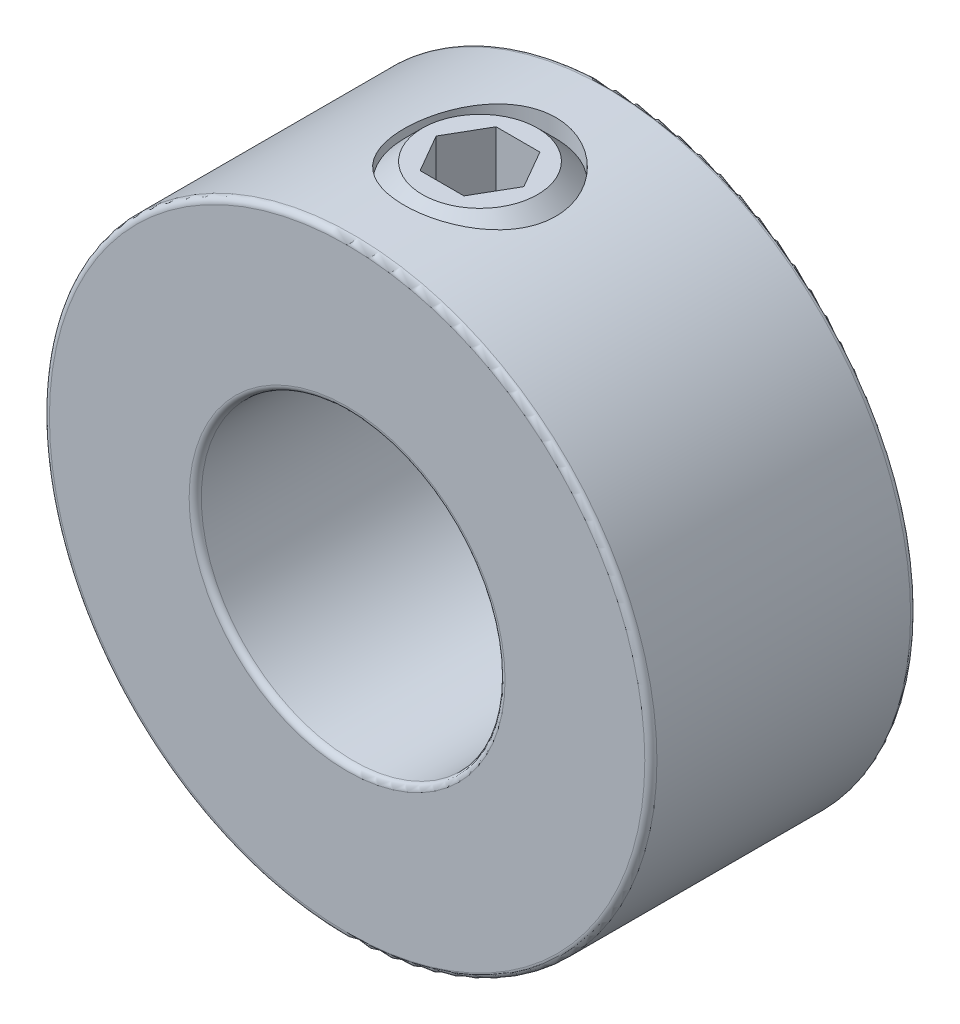
ISO-10303-21;
HEADER;
FILE_DESCRIPTION(('STEP AP214'),'2;1');
FILE_NAME('part.step','',(''),(''),'','','');
FILE_SCHEMA(('AUTOMOTIVE_DESIGN { 1 0 10303 214 1 1 1 1 }'));
ENDSEC;
DATA;
#1=APPLICATION_CONTEXT('core data for automotive mechanical design processes');
#2=APPLICATION_PROTOCOL_DEFINITION('international standard','automotive_design',2000,#1);
#3=PRODUCT_CONTEXT('',#1,'mechanical');
#4=PRODUCT('Part','Part','',(#3));
#5=PRODUCT_RELATED_PRODUCT_CATEGORY('part','',(#4));
#6=PRODUCT_DEFINITION_FORMATION('','',#4);
#7=PRODUCT_DEFINITION_CONTEXT('part definition',#1,'design');
#8=PRODUCT_DEFINITION('design','',#6,#7);
#9=PRODUCT_DEFINITION_SHAPE('','',#8);
#10=(LENGTH_UNIT() NAMED_UNIT(*) SI_UNIT(.MILLI.,.METRE.));
#11=(NAMED_UNIT(*) PLANE_ANGLE_UNIT() SI_UNIT($,.RADIAN.));
#12=(NAMED_UNIT(*) SI_UNIT($,.STERADIAN.) SOLID_ANGLE_UNIT());
#13=UNCERTAINTY_MEASURE_WITH_UNIT(LENGTH_MEASURE(1.E-05),#10,'distance_accuracy_value','');
#14=(GEOMETRIC_REPRESENTATION_CONTEXT(3) GLOBAL_UNCERTAINTY_ASSIGNED_CONTEXT((#13)) GLOBAL_UNIT_ASSIGNED_CONTEXT((#10,
#11,#12)) REPRESENTATION_CONTEXT('',''));
#15=CARTESIAN_POINT('',(0.,0.,0.));
#16=DIRECTION('',(0.,0.,1.));
#17=DIRECTION('',(1.,0.,0.));
#18=AXIS2_PLACEMENT_3D('',#15,#16,#17);
#19=CARTESIAN_POINT('',(0.,12.7,0.));
#20=DIRECTION('',(0.,1.,0.));
#21=DIRECTION('',(-1.,0.,0.));
#22=AXIS2_PLACEMENT_3D('',#19,#20,#21);
#23=PLANE('',#22);
#24=CARTESIAN_POINT('',(0.,12.7,0.));
#25=DIRECTION('',(0.,1.,0.));
#26=DIRECTION('',(-1.,0.,0.));
#27=AXIS2_PLACEMENT_3D('',#24,#25,#26);
#28=CIRCLE('',#27,2.40819263124403);
#29=CARTESIAN_POINT('',(-2.40819263124403,12.7,0.));
#30=VERTEX_POINT('',#29);
#31=EDGE_CURVE('E12',#30,#30,#28,.T.);
#32=ORIENTED_EDGE('',*,*,#31,.T.);
#33=EDGE_LOOP('',(#32));
#34=FACE_BOUND('',#33,.T.);
#35=DIRECTION('',(1.,0.,0.));
#36=VECTOR('',#35,1.);
#37=CARTESIAN_POINT('',(-0.916543552338532,12.7,-1.5875));
#38=LINE('',#37,#36);
#39=CARTESIAN_POINT('',(-0.916543552338532,12.7,-1.5875));
#40=VERTEX_POINT('',#39);
#41=CARTESIAN_POINT('',(0.916543552338531,12.7,-1.5875));
#42=VERTEX_POINT('',#41);
#43=EDGE_CURVE('E110',#40,#42,#38,.T.);
#44=ORIENTED_EDGE('',*,*,#43,.T.);
#45=DIRECTION('',(0.5,0.,0.866025403784439));
#46=VECTOR('',#45,1.);
#47=CARTESIAN_POINT('',(0.916543552338531,12.7,-1.5875));
#48=LINE('',#47,#46);
#49=CARTESIAN_POINT('',(1.83308710467706,12.7,0.));
#50=VERTEX_POINT('',#49);
#51=EDGE_CURVE('E56',#42,#50,#48,.T.);
#52=ORIENTED_EDGE('',*,*,#51,.T.);
#53=DIRECTION('',(-0.5,0.,0.866025403784439));
#54=VECTOR('',#53,1.);
#55=CARTESIAN_POINT('',(1.83308710467706,12.7,0.));
#56=LINE('',#55,#54);
#57=CARTESIAN_POINT('',(0.916543552338533,12.7,1.5875));
#58=VERTEX_POINT('',#57);
#59=EDGE_CURVE('E114',#50,#58,#56,.T.);
#60=ORIENTED_EDGE('',*,*,#59,.T.);
#61=DIRECTION('',(-1.,0.,0.));
#62=VECTOR('',#61,1.);
#63=CARTESIAN_POINT('',(0.916543552338533,12.7,1.5875));
#64=LINE('',#63,#62);
#65=CARTESIAN_POINT('',(-0.916543552338531,12.7,1.5875));
#66=VERTEX_POINT('',#65);
#67=EDGE_CURVE('E177',#58,#66,#64,.T.);
#68=ORIENTED_EDGE('',*,*,#67,.T.);
#69=DIRECTION('',(-0.5,0.,-0.866025403784439));
#70=VECTOR('',#69,1.);
#71=CARTESIAN_POINT('',(-0.916543552338531,12.7,1.5875));
#72=LINE('',#71,#70);
#73=CARTESIAN_POINT('',(-1.83308710467706,12.7,0.));
#74=VERTEX_POINT('',#73);
#75=EDGE_CURVE('E162',#66,#74,#72,.T.);
#76=ORIENTED_EDGE('',*,*,#75,.T.);
#77=DIRECTION('',(0.5,0.,-0.866025403784439));
#78=VECTOR('',#77,1.);
#79=CARTESIAN_POINT('',(-1.83308710467706,12.7,0.));
#80=LINE('',#79,#78);
#81=EDGE_CURVE('E158',#74,#40,#80,.T.);
#82=ORIENTED_EDGE('',*,*,#81,.T.);
#83=EDGE_LOOP('',(#44,#52,#60,#68,#76,#82));
#84=FACE_BOUND('',#83,.T.);
#85=ADVANCED_FACE('F42',(#34,#84),#23,.T.);
#86=CARTESIAN_POINT('',(0.,12.7,0.));
#87=DIRECTION('',(0.,-1.,0.));
#88=DIRECTION('',(1.,0.,0.));
#89=AXIS2_PLACEMENT_3D('',#86,#87,#88);
#90=CONICAL_SURFACE('',#89,2.40819263124403,0.785398163397448);
#91=CARTESIAN_POINT('',(0.,11.933192631244,0.));
#92=DIRECTION('',(0.,1.,0.));
#93=DIRECTION('',(-1.,0.,0.));
#94=AXIS2_PLACEMENT_3D('',#91,#92,#93);
#95=CIRCLE('',#94,3.175);
#96=CARTESIAN_POINT('',(-3.175,11.933192631244,0.));
#97=VERTEX_POINT('',#96);
#98=EDGE_CURVE('E49',#97,#97,#95,.T.);
#99=ORIENTED_EDGE('',*,*,#98,.T.);
#100=EDGE_LOOP('',(#99));
#101=FACE_BOUND('',#100,.T.);
#102=ORIENTED_EDGE('',*,*,#31,.F.);
#103=EDGE_LOOP('',(#102));
#104=FACE_BOUND('',#103,.T.);
#105=ADVANCED_FACE('F132',(#101,#104),#90,.T.);
#106=CARTESIAN_POINT('',(0.,6.35,0.));
#107=DIRECTION('',(0.,1.,0.));
#108=DIRECTION('',(-1.,0.,0.));
#109=AXIS2_PLACEMENT_3D('',#106,#107,#108);
#110=CYLINDRICAL_SURFACE('',#109,3.175);
#111=CARTESIAN_POINT('',(0.,7.11680736875596,0.));
#112=DIRECTION('',(0.,1.,0.));
#113=DIRECTION('',(-1.,0.,0.));
#114=AXIS2_PLACEMENT_3D('',#111,#112,#113);
#115=CIRCLE('',#114,3.175);
#116=CARTESIAN_POINT('',(-3.175,7.11680736875596,0.));
#117=VERTEX_POINT('',#116);
#118=EDGE_CURVE('E127',#117,#117,#115,.T.);
#119=ORIENTED_EDGE('',*,*,#118,.T.);
#120=EDGE_LOOP('',(#119));
#121=FACE_BOUND('',#120,.T.);
#122=ORIENTED_EDGE('',*,*,#98,.F.);
#123=EDGE_LOOP('',(#122));
#124=FACE_BOUND('',#123,.T.);
#125=ADVANCED_FACE('F135',(#121,#124),#110,.T.);
#126=CARTESIAN_POINT('',(0.,7.11680736875596,0.));
#127=DIRECTION('',(0.,1.,0.));
#128=DIRECTION('',(-1.,0.,0.));
#129=AXIS2_PLACEMENT_3D('',#126,#127,#128);
#130=CONICAL_SURFACE('',#129,3.175,0.785398163397449);
#131=CARTESIAN_POINT('',(0.,6.35,0.));
#132=DIRECTION('',(0.,1.,0.));
#133=DIRECTION('',(-1.,0.,0.));
#134=AXIS2_PLACEMENT_3D('',#131,#132,#133);
#135=CIRCLE('',#134,2.40819263124403);
#136=CARTESIAN_POINT('',(-2.40819263124403,6.35,0.));
#137=VERTEX_POINT('',#136);
#138=EDGE_CURVE('E119',#137,#137,#135,.T.);
#139=ORIENTED_EDGE('',*,*,#138,.T.);
#140=EDGE_LOOP('',(#139));
#141=FACE_BOUND('',#140,.T.);
#142=ORIENTED_EDGE('',*,*,#118,.F.);
#143=EDGE_LOOP('',(#142));
#144=FACE_BOUND('',#143,.T.);
#145=ADVANCED_FACE('F137',(#141,#144),#130,.T.);
#146=CARTESIAN_POINT('',(-2.40819263124403,6.35,0.));
#147=DIRECTION('',(0.,-1.,0.));
#148=DIRECTION('',(1.,0.,0.));
#149=AXIS2_PLACEMENT_3D('',#146,#147,#148);
#150=PLANE('',#149);
#151=CARTESIAN_POINT('',(0.,6.35,0.));
#152=DIRECTION('',(0.,1.,0.));
#153=DIRECTION('',(-1.,0.,0.));
#154=AXIS2_PLACEMENT_3D('',#151,#152,#153);
#155=CIRCLE('',#154,0.920168842507158);
#156=CARTESIAN_POINT('',(-0.920168842507158,6.35,0.));
#157=VERTEX_POINT('',#156);
#158=EDGE_CURVE('E115',#157,#157,#155,.T.);
#159=ORIENTED_EDGE('',*,*,#158,.T.);
#160=EDGE_LOOP('',(#159));
#161=FACE_BOUND('',#160,.T.);
#162=ORIENTED_EDGE('',*,*,#138,.F.);
#163=EDGE_LOOP('',(#162));
#164=FACE_BOUND('',#163,.T.);
#165=ADVANCED_FACE('F144',(#161,#164),#150,.T.);
#166=CARTESIAN_POINT('',(0.,6.35,0.));
#167=DIRECTION('',(0.,-1.,0.));
#168=DIRECTION('',(1.,0.,0.));
#169=AXIS2_PLACEMENT_3D('',#166,#167,#168);
#170=CONICAL_SURFACE('',#169,0.920168842507158,0.785398163397448);
#171=CARTESIAN_POINT('',(0.,7.27016884250716,0.));
#172=VERTEX_POINT('',#171);
#173=VERTEX_LOOP('',#172);
#174=FACE_BOUND('',#173,.T.);
#175=ORIENTED_EDGE('',*,*,#158,.F.);
#176=EDGE_LOOP('',(#175));
#177=FACE_BOUND('',#176,.T.);
#178=ADVANCED_FACE('F211',(#174,#177),#170,.F.);
#179=CARTESIAN_POINT('',(0.916543552338531,9.52499999999999,-1.5875));
#180=DIRECTION('',(-0.866025403784439,0.,0.5));
#181=DIRECTION('',(0.5,0.,0.866025403784439));
#182=AXIS2_PLACEMENT_3D('',#179,#180,#181);
#183=PLANE('',#182);
#184=ORIENTED_EDGE('',*,*,#51,.F.);
#185=DIRECTION('',(0.,1.,0.));
#186=VECTOR('',#185,1.);
#187=CARTESIAN_POINT('',(0.916543552338531,9.52499999999999,-1.5875));
#188=LINE('',#187,#186);
#189=CARTESIAN_POINT('',(0.916543552338531,9.52499999999999,-1.5875));
#190=VERTEX_POINT('',#189);
#191=EDGE_CURVE('E109',#190,#42,#188,.T.);
#192=ORIENTED_EDGE('',*,*,#191,.F.);
#193=DIRECTION('',(0.5,0.,0.866025403784439));
#194=VECTOR('',#193,1.);
#195=CARTESIAN_POINT('',(0.916543552338531,9.52499999999999,-1.5875));
#196=LINE('',#195,#194);
#197=CARTESIAN_POINT('',(1.83308710467706,9.52499999999999,0.));
#198=VERTEX_POINT('',#197);
#199=EDGE_CURVE('E100',#190,#198,#196,.T.);
#200=ORIENTED_EDGE('',*,*,#199,.T.);
#201=DIRECTION('',(0.,1.,0.));
#202=VECTOR('',#201,1.);
#203=CARTESIAN_POINT('',(1.83308710467706,9.52499999999999,0.));
#204=LINE('',#203,#202);
#205=EDGE_CURVE('E108',#198,#50,#204,.T.);
#206=ORIENTED_EDGE('',*,*,#205,.T.);
#207=EDGE_LOOP('',(#184,#192,#200,#206));
#208=FACE_BOUND('',#207,.T.);
#209=ADVANCED_FACE('F107',(#208),#183,.T.);
#210=CARTESIAN_POINT('',(1.83308710467706,9.52499999999999,0.));
#211=DIRECTION('',(-0.866025403784439,0.,-0.5));
#212=DIRECTION('',(-0.5,0.,0.866025403784439));
#213=AXIS2_PLACEMENT_3D('',#210,#211,#212);
#214=PLANE('',#213);
#215=ORIENTED_EDGE('',*,*,#59,.F.);
#216=ORIENTED_EDGE('',*,*,#205,.F.);
#217=DIRECTION('',(-0.5,0.,0.866025403784439));
#218=VECTOR('',#217,1.);
#219=CARTESIAN_POINT('',(1.83308710467706,9.52499999999999,0.));
#220=LINE('',#219,#218);
#221=CARTESIAN_POINT('',(0.916543552338533,9.52499999999999,1.5875));
#222=VERTEX_POINT('',#221);
#223=EDGE_CURVE('E96',#198,#222,#220,.T.);
#224=ORIENTED_EDGE('',*,*,#223,.T.);
#225=DIRECTION('',(0.,1.,0.));
#226=VECTOR('',#225,1.);
#227=CARTESIAN_POINT('',(0.916543552338533,9.52499999999999,1.5875));
#228=LINE('',#227,#226);
#229=EDGE_CURVE('E116',#222,#58,#228,.T.);
#230=ORIENTED_EDGE('',*,*,#229,.T.);
#231=EDGE_LOOP('',(#215,#216,#224,#230));
#232=FACE_BOUND('',#231,.T.);
#233=ADVANCED_FACE('F112',(#232),#214,.T.);
#234=CARTESIAN_POINT('',(0.916543552338533,9.52499999999999,1.5875));
#235=DIRECTION('',(0.,0.,-1.));
#236=DIRECTION('',(-1.,0.,0.));
#237=AXIS2_PLACEMENT_3D('',#234,#235,#236);
#238=PLANE('',#237);
#239=ORIENTED_EDGE('',*,*,#67,.F.);
#240=ORIENTED_EDGE('',*,*,#229,.F.);
#241=DIRECTION('',(-1.,0.,0.));
#242=VECTOR('',#241,1.);
#243=CARTESIAN_POINT('',(0.916543552338533,9.52499999999999,1.5875));
#244=LINE('',#243,#242);
#245=CARTESIAN_POINT('',(-0.916543552338531,9.52499999999999,1.5875));
#246=VERTEX_POINT('',#245);
#247=EDGE_CURVE('E102',#222,#246,#244,.T.);
#248=ORIENTED_EDGE('',*,*,#247,.T.);
#249=DIRECTION('',(0.,1.,0.));
#250=VECTOR('',#249,1.);
#251=CARTESIAN_POINT('',(-0.916543552338531,9.52499999999999,1.5875));
#252=LINE('',#251,#250);
#253=EDGE_CURVE('E121',#246,#66,#252,.T.);
#254=ORIENTED_EDGE('',*,*,#253,.T.);
#255=EDGE_LOOP('',(#239,#240,#248,#254));
#256=FACE_BOUND('',#255,.T.);
#257=ADVANCED_FACE('F175',(#256),#238,.T.);
#258=CARTESIAN_POINT('',(-0.916543552338531,9.52499999999999,1.5875));
#259=DIRECTION('',(0.866025403784439,0.,-0.5));
#260=DIRECTION('',(-0.5,0.,-0.866025403784439));
#261=AXIS2_PLACEMENT_3D('',#258,#259,#260);
#262=PLANE('',#261);
#263=ORIENTED_EDGE('',*,*,#75,.F.);
#264=ORIENTED_EDGE('',*,*,#253,.F.);
#265=DIRECTION('',(-0.5,0.,-0.866025403784439));
#266=VECTOR('',#265,1.);
#267=CARTESIAN_POINT('',(-0.916543552338531,9.52499999999999,1.5875));
#268=LINE('',#267,#266);
#269=CARTESIAN_POINT('',(-1.83308710467706,9.52499999999999,0.));
#270=VERTEX_POINT('',#269);
#271=EDGE_CURVE('E188',#246,#270,#268,.T.);
#272=ORIENTED_EDGE('',*,*,#271,.T.);
#273=DIRECTION('',(0.,1.,0.));
#274=VECTOR('',#273,1.);
#275=CARTESIAN_POINT('',(-1.83308710467706,9.52499999999999,0.));
#276=LINE('',#275,#274);
#277=EDGE_CURVE('E170',#270,#74,#276,.T.);
#278=ORIENTED_EDGE('',*,*,#277,.T.);
#279=EDGE_LOOP('',(#263,#264,#272,#278));
#280=FACE_BOUND('',#279,.T.);
#281=ADVANCED_FACE('F179',(#280),#262,.T.);
#282=CARTESIAN_POINT('',(-1.83308710467706,9.52499999999999,0.));
#283=DIRECTION('',(0.866025403784439,0.,0.5));
#284=DIRECTION('',(0.5,0.,-0.866025403784439));
#285=AXIS2_PLACEMENT_3D('',#282,#283,#284);
#286=PLANE('',#285);
#287=ORIENTED_EDGE('',*,*,#81,.F.);
#288=ORIENTED_EDGE('',*,*,#277,.F.);
#289=DIRECTION('',(0.5,0.,-0.866025403784439));
#290=VECTOR('',#289,1.);
#291=CARTESIAN_POINT('',(-1.83308710467706,9.52499999999999,0.));
#292=LINE('',#291,#290);
#293=CARTESIAN_POINT('',(-0.916543552338532,9.52499999999999,-1.5875));
#294=VERTEX_POINT('',#293);
#295=EDGE_CURVE('E186',#270,#294,#292,.T.);
#296=ORIENTED_EDGE('',*,*,#295,.T.);
#297=DIRECTION('',(0.,1.,0.));
#298=VECTOR('',#297,1.);
#299=CARTESIAN_POINT('',(-0.916543552338532,9.52499999999999,-1.5875));
#300=LINE('',#299,#298);
#301=EDGE_CURVE('E167',#294,#40,#300,.T.);
#302=ORIENTED_EDGE('',*,*,#301,.T.);
#303=EDGE_LOOP('',(#287,#288,#296,#302));
#304=FACE_BOUND('',#303,.T.);
#305=ADVANCED_FACE('F192',(#304),#286,.T.);
#306=CARTESIAN_POINT('',(-0.916543552338532,9.52499999999999,-1.5875));
#307=DIRECTION('',(0.,0.,1.));
#308=DIRECTION('',(1.,0.,0.));
#309=AXIS2_PLACEMENT_3D('',#306,#307,#308);
#310=PLANE('',#309);
#311=ORIENTED_EDGE('',*,*,#43,.F.);
#312=ORIENTED_EDGE('',*,*,#301,.F.);
#313=DIRECTION('',(1.,0.,0.));
#314=VECTOR('',#313,1.);
#315=CARTESIAN_POINT('',(-0.916543552338532,9.52499999999999,-1.5875));
#316=LINE('',#315,#314);
#317=EDGE_CURVE('E168',#294,#190,#316,.T.);
#318=ORIENTED_EDGE('',*,*,#317,.T.);
#319=ORIENTED_EDGE('',*,*,#191,.T.);
#320=EDGE_LOOP('',(#311,#312,#318,#319));
#321=FACE_BOUND('',#320,.T.);
#322=ADVANCED_FACE('F193',(#321),#310,.T.);
#323=CARTESIAN_POINT('',(0.916543552338531,9.52499999999999,-1.5875));
#324=DIRECTION('',(0.,1.,0.));
#325=DIRECTION('',(0.,0.,1.));
#326=AXIS2_PLACEMENT_3D('',#323,#324,#325);
#327=PLANE('',#326);
#328=ORIENTED_EDGE('',*,*,#199,.F.);
#329=ORIENTED_EDGE('',*,*,#317,.F.);
#330=ORIENTED_EDGE('',*,*,#295,.F.);
#331=ORIENTED_EDGE('',*,*,#271,.F.);
#332=ORIENTED_EDGE('',*,*,#247,.F.);
#333=ORIENTED_EDGE('',*,*,#223,.F.);
#334=EDGE_LOOP('',(#328,#329,#330,#331,#332,#333));
#335=FACE_BOUND('',#334,.T.);
#336=ADVANCED_FACE('F98',(#335),#327,.T.);
#337=CLOSED_SHELL('',(#85,#105,#125,#145,#165,#178,#209,#233,#257,#281,#305,#322,#336));
#338=MANIFOLD_SOLID_BREP('B2',#337);
#339=CARTESIAN_POINT('',(0.,0.,5.55625));
#340=DIRECTION('',(0.,0.,1.));
#341=DIRECTION('',(1.,0.,0.));
#342=AXIS2_PLACEMENT_3D('',#339,#340,#341);
#343=PLANE('',#342);
#344=CARTESIAN_POINT('',(0.,0.,5.55625));
#345=DIRECTION('',(0.,0.,1.));
#346=DIRECTION('',(1.,0.,0.));
#347=AXIS2_PLACEMENT_3D('',#344,#345,#346);
#348=CIRCLE('',#347,6.604);
#349=CARTESIAN_POINT('',(6.604,0.,5.55625));
#350=VERTEX_POINT('',#349);
#351=EDGE_CURVE('E336',#350,#350,#348,.F.);
#352=ORIENTED_EDGE('',*,*,#351,.T.);
#353=EDGE_LOOP('',(#352));
#354=FACE_BOUND('',#353,.T.);
#355=CARTESIAN_POINT('',(0.,0.,5.55625));
#356=DIRECTION('',(0.,0.,1.));
#357=DIRECTION('',(1.,0.,0.));
#358=AXIS2_PLACEMENT_3D('',#355,#356,#357);
#359=CIRCLE('',#358,12.446);
#360=CARTESIAN_POINT('',(12.446,0.,5.55625));
#361=VERTEX_POINT('',#360);
#362=EDGE_CURVE('E340',#361,#361,#359,.T.);
#363=ORIENTED_EDGE('',*,*,#362,.T.);
#364=EDGE_LOOP('',(#363));
#365=FACE_BOUND('',#364,.T.);
#366=ADVANCED_FACE('F325',(#354,#365),#343,.T.);
#367=CARTESIAN_POINT('',(0.,0.,-5.55625));
#368=DIRECTION('',(0.,0.,1.));
#369=DIRECTION('',(1.,0.,0.));
#370=AXIS2_PLACEMENT_3D('',#367,#368,#369);
#371=PLANE('',#370);
#372=CARTESIAN_POINT('',(0.,0.,-5.55625));
#373=DIRECTION('',(0.,0.,1.));
#374=DIRECTION('',(1.,0.,0.));
#375=AXIS2_PLACEMENT_3D('',#372,#373,#374);
#376=CIRCLE('',#375,6.604);
#377=CARTESIAN_POINT('',(6.604,0.,-5.55625));
#378=VERTEX_POINT('',#377);
#379=EDGE_CURVE('E351',#378,#378,#376,.T.);
#380=ORIENTED_EDGE('',*,*,#379,.T.);
#381=EDGE_LOOP('',(#380));
#382=FACE_BOUND('',#381,.T.);
#383=CARTESIAN_POINT('',(0.,0.,-5.55625));
#384=DIRECTION('',(0.,0.,1.));
#385=DIRECTION('',(1.,0.,0.));
#386=AXIS2_PLACEMENT_3D('',#383,#384,#385);
#387=CIRCLE('',#386,12.446);
#388=CARTESIAN_POINT('',(12.446,0.,-5.55625));
#389=VERTEX_POINT('',#388);
#390=EDGE_CURVE('E354',#389,#389,#387,.F.);
#391=ORIENTED_EDGE('',*,*,#390,.T.);
#392=EDGE_LOOP('',(#391));
#393=FACE_BOUND('',#392,.T.);
#394=ADVANCED_FACE('F388',(#382,#393),#371,.F.);
#395=CARTESIAN_POINT('',(0.,0.,5.55625));
#396=DIRECTION('',(0.,0.,-1.));
#397=DIRECTION('',(-1.,0.,0.));
#398=AXIS2_PLACEMENT_3D('',#395,#396,#397);
#399=CYLINDRICAL_SURFACE('',#398,12.7);
#400=CARTESIAN_POINT('',(0.,0.,-5.30225));
#401=DIRECTION('',(0.,0.,1.));
#402=DIRECTION('',(1.,0.,0.));
#403=AXIS2_PLACEMENT_3D('',#400,#401,#402);
#404=CIRCLE('',#403,12.7);
#405=CARTESIAN_POINT('',(12.7,0.,-5.30225));
#406=VERTEX_POINT('',#405);
#407=EDGE_CURVE('E41',#406,#406,#404,.T.);
#408=ORIENTED_EDGE('',*,*,#407,.T.);
#409=EDGE_LOOP('',(#408));
#410=FACE_BOUND('',#409,.T.);
#411=CARTESIAN_POINT('',(0.,0.,5.30225));
#412=DIRECTION('',(0.,0.,1.));
#413=DIRECTION('',(1.,0.,0.));
#414=AXIS2_PLACEMENT_3D('',#411,#412,#413);
#415=CIRCLE('',#414,12.7);
#416=CARTESIAN_POINT('',(12.7,0.,5.30225));
#417=VERTEX_POINT('',#416);
#418=EDGE_CURVE('E332',#417,#417,#415,.F.);
#419=ORIENTED_EDGE('',*,*,#418,.T.);
#420=EDGE_LOOP('',(#419));
#421=FACE_BOUND('',#420,.T.);
#422=CARTESIAN_POINT('',(0.,12.7,-3.175));
#423=CARTESIAN_POINT('',(0.175421054350931,12.6999970338729,-3.17499507718756));
#424=CARTESIAN_POINT('',(0.350897100741782,12.6963292371237,-3.16041288419548));
#425=CARTESIAN_POINT('',(0.69682005198096,12.6820530760661,-3.10255676306683));
#426=CARTESIAN_POINT('',(0.867264049209731,12.6714407780562,-3.05926657314488));
#427=CARTESIAN_POINT('',(1.19807751278645,12.6444507573613,-2.94547024683858));
#428=CARTESIAN_POINT('',(1.35845880926017,12.6280799601569,-2.87499679271934));
#429=CARTESIAN_POINT('',(1.6651226791977,12.591316443928,-2.70894939107175));
#430=CARTESIAN_POINT('',(1.81140477687155,12.5709235892463,-2.61337459688152));
#431=CARTESIAN_POINT('',(2.08873074612027,12.5278602543575,-2.39775832856532));
#432=CARTESIAN_POINT('',(2.2194428772959,12.5051546346353,-2.27729716633665));
#433=CARTESIAN_POINT('',(2.45903522924702,12.4602582924963,-2.01622616627587));
#434=CARTESIAN_POINT('',(2.56791298487579,12.4380676284689,-1.87561405642898));
#435=CARTESIAN_POINT('',(2.76230618225783,12.3963594189446,-1.57565677007337));
#436=CARTESIAN_POINT('',(2.84745052370821,12.3768864828385,-1.41606432812152));
#437=CARTESIAN_POINT('',(2.98957345643241,12.343330973648,-1.08426586198626));
#438=CARTESIAN_POINT('',(3.04655655068163,12.3292475388652,-0.912061859447231));
#439=CARTESIAN_POINT('',(3.12960773790342,12.3084267567388,-0.563576262139818));
#440=CARTESIAN_POINT('',(3.15627230130284,12.3015478927701,-0.387445470052915));
#441=CARTESIAN_POINT('',(3.17978742389056,12.2954915053947,-0.0330865289513835));
#442=CARTESIAN_POINT('',(3.176642833515,12.2963127290578,0.145141274131692));
#443=CARTESIAN_POINT('',(3.14110481048737,12.3054365167726,0.494063459727666));
#444=CARTESIAN_POINT('',(3.10942215340351,12.3135572669877,0.664835732101618));
#445=CARTESIAN_POINT('',(3.01884119561133,12.3360753547043,0.998560891095076));
#446=CARTESIAN_POINT('',(2.95994095604688,12.3504731393489,1.16151321974455));
#447=CARTESIAN_POINT('',(2.81599106163371,12.3840899110031,1.47687880106701));
#448=CARTESIAN_POINT('',(2.73068344564301,12.4033560981111,1.62916906362126));
#449=CARTESIAN_POINT('',(2.53652078423164,12.4445122129068,1.91752793565194));
#450=CARTESIAN_POINT('',(2.42766161831204,12.4664025994163,2.05359370007568));
#451=CARTESIAN_POINT('',(2.18580424890858,12.5111061380944,2.30971431988649));
#452=CARTESIAN_POINT('',(2.05220624645107,12.533927803951,2.42920200396319));
#453=CARTESIAN_POINT('',(1.76659522538283,12.5773596047503,2.64418496321526));
#454=CARTESIAN_POINT('',(1.61458164448181,12.5979696721291,2.73967950552455));
#455=CARTESIAN_POINT('',(1.29564529770895,12.6347586626604,2.90417374084162));
#456=CARTESIAN_POINT('',(1.12867311562492,12.6509221227036,2.97308130353854));
#457=CARTESIAN_POINT('',(0.785020883902435,12.676884242985,3.0816916304186));
#458=CARTESIAN_POINT('',(0.608342698201859,12.6866841206814,3.12139998108506));
#459=CARTESIAN_POINT('',(0.255142937325556,12.6986347345774,3.16961851376621));
#460=CARTESIAN_POINT('',(0.078733057308377,12.7009747992585,3.17890107185939));
#461=CARTESIAN_POINT('',(-0.273119584996527,12.6982813685726,3.16812294564922));
#462=CARTESIAN_POINT('',(-0.448562432914396,12.6932485369526,3.14806490274183));
#463=CARTESIAN_POINT('',(-0.790816868910238,12.6764961338622,3.07981157723825));
#464=CARTESIAN_POINT('',(-0.957717835150521,12.6648767569325,3.03203765897374));
#465=CARTESIAN_POINT('',(-1.28112793569116,12.6362609570897,2.91019000547309));
#466=CARTESIAN_POINT('',(-1.43763601861911,12.6192639911647,2.83611361420368));
#467=CARTESIAN_POINT('',(-1.73889063454314,12.5813250177716,2.6622668605486));
#468=CARTESIAN_POINT('',(-1.88337918521903,12.5603183592593,2.56206389542727));
#469=CARTESIAN_POINT('',(-2.15376466554501,12.5167921111412,2.33936135971267));
#470=CARTESIAN_POINT('',(-2.27965837982672,12.4942722608556,2.21685794114268));
#471=CARTESIAN_POINT('',(-2.51246336908675,12.4495762556412,1.94944584954746));
#472=CARTESIAN_POINT('',(-2.6188328531313,12.4274221051899,1.80406102865082));
#473=CARTESIAN_POINT('',(-2.80566443991221,12.3865825924258,1.49704925704163));
#474=CARTESIAN_POINT('',(-2.88612769264178,12.3678970761538,1.335423027713));
#475=CARTESIAN_POINT('',(-3.0182638402854,12.3363163381503,1.00138288757303));
#476=CARTESIAN_POINT('',(-3.07010730622843,12.3233869021911,0.829039853404032));
#477=CARTESIAN_POINT('',(-3.14398164687971,12.3047494152553,0.477711266541238));
#478=CARTESIAN_POINT('',(-3.16601904149253,12.299039785006,0.298727175343936));
#479=CARTESIAN_POINT('',(-3.17931501621074,12.2956087422145,-0.0552895005203962));
#480=CARTESIAN_POINT('',(-3.17143955029538,12.2976625750886,-0.230287904387485));
#481=CARTESIAN_POINT('',(-3.1271152390873,12.3090074061494,-0.576376564376255));
#482=CARTESIAN_POINT('',(-3.09066696801937,12.3182982588945,-0.747466898966899));
#483=CARTESIAN_POINT('',(-2.9907046261569,12.3429450180984,-1.07994123834368));
#484=CARTESIAN_POINT('',(-2.92735297324093,12.3582644892528,-1.24137696275537));
#485=CARTESIAN_POINT('',(-2.7755107337966,12.3932474960913,-1.5514433934137));
#486=CARTESIAN_POINT('',(-2.68701666057215,12.4129116342002,-1.70007231991313));
#487=CARTESIAN_POINT('',(-2.48468673461549,12.4550092586011,-1.98449063138675));
#488=CARTESIAN_POINT('',(-2.37025002816433,12.4775016056118,-2.11984393874715));
#489=CARTESIAN_POINT('',(-2.12045416901821,12.5223699100401,-2.36970791148384));
#490=CARTESIAN_POINT('',(-1.98509005500274,12.5447458385544,-2.48421362040584));
#491=CARTESIAN_POINT('',(-1.6943230585205,12.5873437112106,-2.69115393646168));
#492=CARTESIAN_POINT('',(-1.53860166056969,12.6075193062447,-2.78315126560482));
#493=CARTESIAN_POINT('',(-1.21341315929717,12.6429542453062,-2.93951546322414));
#494=CARTESIAN_POINT('',(-1.04395600927443,12.6582171100619,-3.0039021300394));
#495=CARTESIAN_POINT('',(-0.729001702698682,12.6798505941374,-3.09366037419776));
#496=CARTESIAN_POINT('',(-0.585004695088745,12.6873547169486,-3.12409679779643));
#497=CARTESIAN_POINT('',(-0.294017851418465,12.6974304774096,-3.16476791399977));
#498=CARTESIAN_POINT('',(-0.147028241296871,12.7000024860439,-3.17500412602955));
#499=CARTESIAN_POINT('',(0.,12.7,-3.175));
#500=B_SPLINE_CURVE_WITH_KNOTS('',3,(#422,#423,#424,#425,#426,#427,#428,#429,#430,#431,#432,
#433,#434,#435,#436,#437,#438,#439,#440,#441,#442,#443,#444,#445,#446,#447,#448,#449,#450,#451,
#452,#453,#454,#455,#456,#457,#458,#459,#460,#461,#462,#463,#464,#465,#466,#467,#468,#469,#470,
#471,#472,#473,#474,#475,#476,#477,#478,#479,#480,#481,#482,#483,#484,#485,#486,#487,#488,#489,
#490,#491,#492,#493,#494,#495,#496,#497,#498,#499),.UNSPECIFIED.,.T.,.F.,(4,2,2,2,2,2,2,2,2,2,2,
2,2,2,2,2,2,2,2,2,2,2,2,2,2,2,2,2,2,2,2,2,2,2,2,2,2,2,4),(0.,0.5257243580655,1.05174676993359,
1.57713870983892,2.10254837335841,2.63767221675277,3.17285644277797,3.71599137305291,
4.25903942808496,4.79120824630597,5.3232904734557,5.84247618671883,6.36169889010143,
6.88616284006739,7.41071862276906,7.95023177058119,8.48976139571985,9.0311441807632,
9.57242335981323,10.09985087283,10.6272309069567,11.1467958106174,11.6664131950588,
12.1952509368702,12.7241800170734,13.266092111565,13.8079801469349,14.34660272276,
14.885107458967,15.4081433519175,15.9311687337377,16.4510804786766,16.9710643590661,
17.5046127008447,18.0382877269755,18.5816279265763,19.1245778677202,19.5652441424438,
20.005877269746),.UNSPECIFIED.);
#501=CARTESIAN_POINT('',(0.,12.7,-3.175));
#502=VERTEX_POINT('',#501);
#503=EDGE_CURVE('E357',#502,#502,#500,.T.);
#504=ORIENTED_EDGE('',*,*,#503,.T.);
#505=EDGE_LOOP('',(#504));
#506=FACE_BOUND('',#505,.T.);
#507=ADVANCED_FACE('F384',(#410,#421,#506),#399,.T.);
#508=CARTESIAN_POINT('',(0.,0.,5.55625));
#509=DIRECTION('',(0.,0.,-1.));
#510=DIRECTION('',(-1.,0.,0.));
#511=AXIS2_PLACEMENT_3D('',#508,#509,#510);
#512=CYLINDRICAL_SURFACE('',#511,6.35);
#513=CARTESIAN_POINT('',(0.,0.,-5.30225));
#514=DIRECTION('',(0.,0.,1.));
#515=DIRECTION('',(1.,0.,0.));
#516=AXIS2_PLACEMENT_3D('',#513,#514,#515);
#517=CIRCLE('',#516,6.35);
#518=CARTESIAN_POINT('',(6.35,0.,-5.30225));
#519=VERTEX_POINT('',#518);
#520=EDGE_CURVE('E345',#519,#519,#517,.F.);
#521=ORIENTED_EDGE('',*,*,#520,.T.);
#522=EDGE_LOOP('',(#521));
#523=FACE_BOUND('',#522,.T.);
#524=CARTESIAN_POINT('',(0.,0.,5.30225));
#525=DIRECTION('',(0.,0.,1.));
#526=DIRECTION('',(1.,0.,0.));
#527=AXIS2_PLACEMENT_3D('',#524,#525,#526);
#528=CIRCLE('',#527,6.35);
#529=CARTESIAN_POINT('',(6.35,0.,5.30225));
#530=VERTEX_POINT('',#529);
#531=EDGE_CURVE('E348',#530,#530,#528,.T.);
#532=ORIENTED_EDGE('',*,*,#531,.T.);
#533=EDGE_LOOP('',(#532));
#534=FACE_BOUND('',#533,.T.);
#535=CARTESIAN_POINT('',(0.,6.35,-3.175));
#536=CARTESIAN_POINT('',(0.0834969220594998,6.34999931166444,-3.17499911228237));
#537=CARTESIAN_POINT('',(0.167002655580042,6.34834758911701,-3.17170012555404));
#538=CARTESIAN_POINT('',(0.333378330258781,6.34179105821714,-3.1585541254501));
#539=CARTESIAN_POINT('',(0.416247978955771,6.33688483467113,-3.14870426347422));
#540=CARTESIAN_POINT('',(0.66318203064701,6.31742426748325,-3.10942793495398));
#541=CARTESIAN_POINT('',(0.825450146761554,6.29812827299425,-3.0702749225986));
#542=CARTESIAN_POINT('',(1.13965128900426,6.2489182313574,-2.96800928870585));
#543=CARTESIAN_POINT('',(1.29162180811868,6.21904547786825,-2.90498978075659));
#544=CARTESIAN_POINT('',(1.58264035037879,6.15142812041637,-2.7572639263711));
#545=CARTESIAN_POINT('',(1.72168939123018,6.11368413715877,-2.67255928984904));
#546=CARTESIAN_POINT('',(1.99234108848171,6.03111096182982,-2.47803037026577));
#547=CARTESIAN_POINT('',(2.12298433900091,5.98599127270818,-2.36699642220607));
#548=CARTESIAN_POINT('',(2.36467069069853,5.89470535591056,-2.12560331642721));
#549=CARTESIAN_POINT('',(2.47569885601321,5.84853836069043,-1.99522957023356));
#550=CARTESIAN_POINT('',(2.68368848497886,5.75623634934464,-1.70657905224668));
#551=CARTESIAN_POINT('',(2.77889135161934,5.71038146176788,-1.54692246869841));
#552=CARTESIAN_POINT('',(2.90019349951534,5.64919759286363,-1.29545201282556));
#553=CARTESIAN_POINT('',(2.93705266116891,5.63006420805933,-1.20959993817132));
#554=CARTESIAN_POINT('',(3.00322508739606,5.59504604853268,-1.03441438629357));
#555=CARTESIAN_POINT('',(3.03254280972159,5.57915935583429,-0.945083001819443));
#556=CARTESIAN_POINT('',(3.08174263292982,5.55212611635049,-0.768989448035253));
#557=CARTESIAN_POINT('',(3.10208128111978,5.54075429137746,-0.682389205971432));
#558=CARTESIAN_POINT('',(3.13545600360765,5.52193654886444,-0.507412721005597));
#559=CARTESIAN_POINT('',(3.14849595237257,5.51448854851135,-0.419037446228295));
#560=CARTESIAN_POINT('',(3.1670771305344,5.50383875782919,-0.241293261151379));
#561=CARTESIAN_POINT('',(3.17262287599649,5.50063441026522,-0.151924982012598));
#562=CARTESIAN_POINT('',(3.17614778806993,5.49859788398609,0.026980784178089));
#563=CARTESIAN_POINT('',(3.17412767659872,5.49976528812799,0.116518254271341));
#564=CARTESIAN_POINT('',(3.1581193033026,5.50899190362733,0.362747875724408));
#565=CARTESIAN_POINT('',(3.13621253452965,5.52160857357707,0.518841729813368));
#566=CARTESIAN_POINT('',(3.07003746372168,5.55866493052824,0.824646641306534));
#567=CARTESIAN_POINT('',(3.02576203854504,5.58310838358077,0.974355649022768));
#568=CARTESIAN_POINT('',(2.91531509833647,5.64157885407237,1.26754429656415));
#569=CARTESIAN_POINT('',(2.84865758129417,5.67581583876129,1.41079760993663));
#570=CARTESIAN_POINT('',(2.69570761526054,5.75003268807633,1.68476608617402));
#571=CARTESIAN_POINT('',(2.60940634674629,5.79001512927804,1.81547557960851));
#572=CARTESIAN_POINT('',(2.40685964249565,5.87734289018611,2.0781042742503));
#573=CARTESIAN_POINT('',(2.28820488335253,5.92497898403936,2.20807538485651));
#574=CARTESIAN_POINT('',(2.03058898448427,6.01813700574905,2.44708514286385));
#575=CARTESIAN_POINT('',(1.89161819563546,6.06365791538158,2.5561137863587));
#576=CARTESIAN_POINT('',(1.58913989972482,6.1500381059768,2.75490191971972));
#577=CARTESIAN_POINT('',(1.42479265164788,6.19058274974572,2.84353148557995));
#578=CARTESIAN_POINT('',(1.08098023585583,6.25976272299952,2.99115808163535));
#579=CARTESIAN_POINT('',(0.901527205073894,6.28840750578946,3.05017864113171));
#580=CARTESIAN_POINT('',(0.548533610626832,6.32854759690358,3.13205940339905));
#581=CARTESIAN_POINT('',(0.375734359385243,6.34126679122995,3.15750967258734));
#582=CARTESIAN_POINT('',(0.0278752299448304,6.35231817716325,3.17965052226026));
#583=CARTESIAN_POINT('',(-0.14718353806002,6.35065718436129,3.17635472713933));
#584=CARTESIAN_POINT('',(-0.480164686080363,6.33384535408399,3.14259376405461));
#585=CARTESIAN_POINT('',(-0.638363620564191,6.31975005060431,3.11425420852516));
#586=CARTESIAN_POINT('',(-0.947441883053002,6.28085393924121,3.03454412179011));
#587=CARTESIAN_POINT('',(-1.09832040207141,6.25605195113515,2.98317105152272));
#588=CARTESIAN_POINT('',(-1.39347133182512,6.19709998236334,2.8575048690622));
#589=CARTESIAN_POINT('',(-1.53743151047822,6.16270299610717,2.78259841588881));
#590=CARTESIAN_POINT('',(-1.8112148234104,6.08787118465664,2.61268357431413));
#591=CARTESIAN_POINT('',(-1.94103189959928,6.0474337895468,2.5176666226146));
#592=CARTESIAN_POINT('',(-2.19636241342679,5.95973602709938,2.29946064962623));
#593=CARTESIAN_POINT('',(-2.3202013468198,5.91219559251098,2.17442139288844));
#594=CARTESIAN_POINT('',(-2.54589381918874,5.81858093231368,1.90523764485025));
#595=CARTESIAN_POINT('',(-2.6477321493525,5.77250773963547,1.76108004761907));
#596=CARTESIAN_POINT('',(-2.83117262876716,5.68487535288742,1.44893139804165));
#597=CARTESIAN_POINT('',(-2.91155594998014,5.64364281441821,1.28012423048962));
#598=CARTESIAN_POINT('',(-3.04191297152938,5.5744767953732,0.928655535110328));
#599=CARTESIAN_POINT('',(-3.0919258549222,5.54652618900869,0.746012202152618));
#600=CARTESIAN_POINT('',(-3.15551086037918,5.51057765714603,0.390810043529834));
#601=CARTESIAN_POINT('',(-3.17212027309711,5.50092192343245,0.218966249592787));
#602=CARTESIAN_POINT('',(-3.17718805563876,5.49800001145358,-0.125244442495205));
#603=CARTESIAN_POINT('',(-3.16565862768385,5.50472672904441,-0.297611081542638));
#604=CARTESIAN_POINT('',(-3.11761548073658,5.53205211477784,-0.620660103073908));
#605=CARTESIAN_POINT('',(-3.08358651207686,5.5512682307627,-0.771843941731147));
#606=CARTESIAN_POINT('',(-2.99458164828807,5.59977978302582,-1.06619083016717));
#607=CARTESIAN_POINT('',(-2.93959901505999,5.62907846127335,-1.2093512828503));
#608=CARTESIAN_POINT('',(-2.8061154442137,5.69685576337174,-1.49423369942854));
#609=CARTESIAN_POINT('',(-2.72628260503929,5.73581889480533,-1.63521280936567));
#610=CARTESIAN_POINT('',(-2.54682759156583,5.81772207082382,-1.9026974317231));
#611=CARTESIAN_POINT('',(-2.44719512169931,5.8606641782013,-2.02919535994271));
#612=CARTESIAN_POINT('',(-2.21680287661218,5.95192753761204,-2.28009752417706));
#613=CARTESIAN_POINT('',(-2.08373188558712,6.00026839877347,-2.40237975641279));
#614=CARTESIAN_POINT('',(-1.79751265125243,6.0921234557675,-2.62339787323311));
#615=CARTESIAN_POINT('',(-1.64435365457427,6.13563504323043,-2.72212106598272));
#616=CARTESIAN_POINT('',(-1.40178715704487,6.19391073190243,-2.85028026619707));
#617=CARTESIAN_POINT('',(-1.31842200030918,6.21223173271383,-2.88980058368139));
#618=CARTESIAN_POINT('',(-1.1480770102167,6.24595363475604,-2.9615994748237));
#619=CARTESIAN_POINT('',(-1.06109897786306,6.26135597012704,-2.99388160653437));
#620=CARTESIAN_POINT('',(-0.884361322813102,6.28875097111981,-3.050759345915));
#621=CARTESIAN_POINT('',(-0.794608244970565,6.30075106809478,-3.07537171813811));
#622=CARTESIAN_POINT('',(-0.612925661591577,6.32100983571903,-3.11666738952989));
#623=CARTESIAN_POINT('',(-0.520997521680286,6.3292707916836,-3.13335553219354));
#624=CARTESIAN_POINT('',(-0.357531347524372,6.34032503263334,-3.15561628486238));
#625=CARTESIAN_POINT('',(-0.286274046488593,6.34394670812889,-3.16287882124963));
#626=CARTESIAN_POINT('',(-0.143346668941345,6.34878452045567,-3.17257112653757));
#627=CARTESIAN_POINT('',(-0.0716765810914251,6.35000059089052,-3.17500076204682));
#628=CARTESIAN_POINT('',(0.,6.35,-3.175));
#629=B_SPLINE_CURVE_WITH_KNOTS('',3,(#535,#536,#537,#538,#539,#540,#541,#542,#543,#544,#545,
#546,#547,#548,#549,#550,#551,#552,#553,#554,#555,#556,#557,#558,#559,#560,#561,#562,#563,#564,
#565,#566,#567,#568,#569,#570,#571,#572,#573,#574,#575,#576,#577,#578,#579,#580,#581,#582,#583,
#584,#585,#586,#587,#588,#589,#590,#591,#592,#593,#594,#595,#596,#597,#598,#599,#600,#601,#602,
#603,#604,#605,#606,#607,#608,#609,#610,#611,#612,#613,#614,#615,#616,#617,#618,#619,#620,#621,
#622,#623,#624,#625,#626,#627,#628),.UNSPECIFIED.,.T.,.F.,(4,2,2,2,2,2,2,2,2,2,2,2,2,2,2,2,2,2,
2,2,2,2,2,2,2,2,2,2,2,2,2,2,2,2,2,2,2,2,2,2,2,2,2,2,2,2,4),(0.,0.25041561210268,
0.500940186864014,1.00234854488129,1.50182051324263,2.00125310940106,2.53090025348452,
3.06094897410615,3.63210298373098,3.91787290005988,4.20347350732849,4.47213270490102,
4.74064915090148,5.00900371453887,5.27733267302576,5.74927594687739,6.22136960256846,
6.70445970327764,7.18776712794021,7.73235646527881,8.27720530143646,8.84735553323666,
9.41705196489304,9.93956405039339,10.4618285011675,10.9436138594975,11.4254523397102,
11.9210677568139,12.4168946391879,12.9614122158798,13.5063050164601,14.0775857365549,
14.6481278321882,15.1639000911419,15.6794487286237,16.1458838633213,16.6124691169503,
17.1104020806943,17.6085946442304,18.1673210354482,18.7263477502426,19.0082017078365,
19.2899168101042,19.5710117490933,19.8519346536844,20.0668939492148,20.2818591776892),.UNSPECIFIED.);
#630=CARTESIAN_POINT('',(0.,6.35,-3.175));
#631=VERTEX_POINT('',#630);
#632=EDGE_CURVE('E358',#631,#631,#629,.T.);
#633=ORIENTED_EDGE('',*,*,#632,.F.);
#634=EDGE_LOOP('',(#633));
#635=FACE_BOUND('',#634,.T.);
#636=ADVANCED_FACE('F368',(#523,#534,#635),#512,.F.);
#637=CARTESIAN_POINT('',(0.,12.7,0.));
#638=DIRECTION('',(0.,-1.,0.));
#639=DIRECTION('',(0.,0.,-1.));
#640=AXIS2_PLACEMENT_3D('',#637,#638,#639);
#641=CYLINDRICAL_SURFACE('',#640,3.175);
#642=ORIENTED_EDGE('',*,*,#632,.T.);
#643=EDGE_LOOP('',(#642));
#644=FACE_BOUND('',#643,.T.);
#645=ORIENTED_EDGE('',*,*,#503,.F.);
#646=EDGE_LOOP('',(#645));
#647=FACE_BOUND('',#646,.T.);
#648=ADVANCED_FACE('F371',(#644,#647),#641,.F.);
#649=CARTESIAN_POINT('',(0.,0.,-5.30225));
#650=DIRECTION('',(0.,0.,1.));
#651=DIRECTION('',(1.,0.,0.));
#652=AXIS2_PLACEMENT_3D('',#649,#650,#651);
#653=TOROIDAL_SURFACE('',#652,6.604,0.254);
#654=ORIENTED_EDGE('',*,*,#520,.F.);
#655=EDGE_LOOP('',(#654));
#656=FACE_BOUND('',#655,.T.);
#657=ORIENTED_EDGE('',*,*,#379,.F.);
#658=EDGE_LOOP('',(#657));
#659=FACE_BOUND('',#658,.T.);
#660=ADVANCED_FACE('F374',(#656,#659),#653,.T.);
#661=CARTESIAN_POINT('',(0.,0.,5.30225));
#662=DIRECTION('',(0.,0.,1.));
#663=DIRECTION('',(1.,0.,0.));
#664=AXIS2_PLACEMENT_3D('',#661,#662,#663);
#665=TOROIDAL_SURFACE('',#664,6.604,0.254);
#666=ORIENTED_EDGE('',*,*,#351,.F.);
#667=EDGE_LOOP('',(#666));
#668=FACE_BOUND('',#667,.T.);
#669=ORIENTED_EDGE('',*,*,#531,.F.);
#670=EDGE_LOOP('',(#669));
#671=FACE_BOUND('',#670,.T.);
#672=ADVANCED_FACE('F381',(#668,#671),#665,.T.);
#673=CARTESIAN_POINT('',(0.,0.,-5.30225));
#674=DIRECTION('',(0.,0.,1.));
#675=DIRECTION('',(1.,0.,0.));
#676=AXIS2_PLACEMENT_3D('',#673,#674,#675);
#677=TOROIDAL_SURFACE('',#676,12.446,0.254);
#678=ORIENTED_EDGE('',*,*,#390,.F.);
#679=EDGE_LOOP('',(#678));
#680=FACE_BOUND('',#679,.T.);
#681=ORIENTED_EDGE('',*,*,#407,.F.);
#682=EDGE_LOOP('',(#681));
#683=FACE_BOUND('',#682,.T.);
#684=ADVANCED_FACE('F400',(#680,#683),#677,.T.);
#685=CARTESIAN_POINT('',(0.,0.,5.30225));
#686=DIRECTION('',(0.,0.,1.));
#687=DIRECTION('',(1.,0.,0.));
#688=AXIS2_PLACEMENT_3D('',#685,#686,#687);
#689=TOROIDAL_SURFACE('',#688,12.446,0.254);
#690=ORIENTED_EDGE('',*,*,#418,.F.);
#691=EDGE_LOOP('',(#690));
#692=FACE_BOUND('',#691,.T.);
#693=ORIENTED_EDGE('',*,*,#362,.F.);
#694=EDGE_LOOP('',(#693));
#695=FACE_BOUND('',#694,.T.);
#696=ADVANCED_FACE('F327',(#692,#695),#689,.T.);
#697=CLOSED_SHELL('',(#366,#394,#507,#636,#648,#660,#672,#684,#696));
#698=MANIFOLD_SOLID_BREP('B6',#697);
#699=ADVANCED_BREP_SHAPE_REPRESENTATION('',(#18,#338,#698),#14);
#700=SHAPE_DEFINITION_REPRESENTATION(#9,#699);
ENDSEC;
END-ISO-10303-21;
